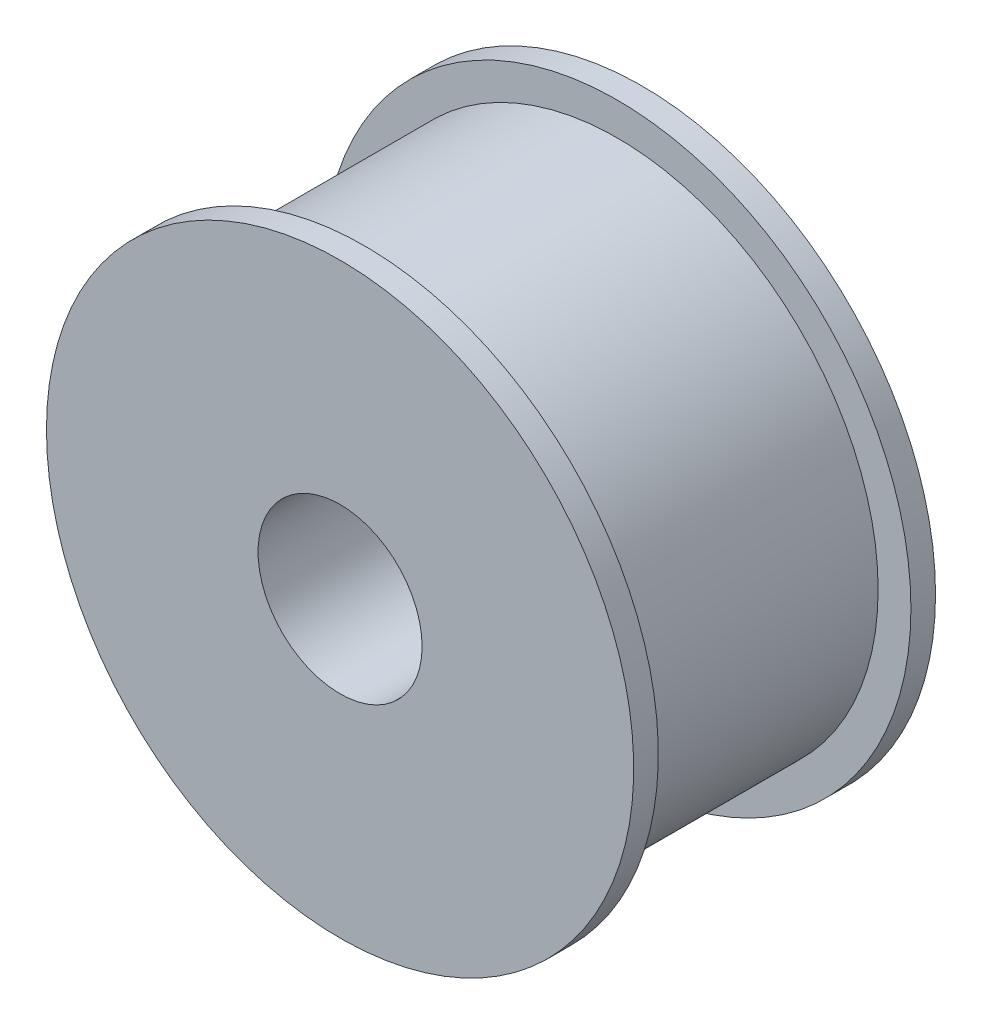
ISO-10303-21;
HEADER;
FILE_DESCRIPTION(('STEP AP214'),'2;1');
FILE_NAME('part.step','',(''),(''),'','','');
FILE_SCHEMA(('AUTOMOTIVE_DESIGN { 1 0 10303 214 1 1 1 1 }'));
ENDSEC;
DATA;
#1=APPLICATION_CONTEXT('core data for automotive mechanical design processes');
#2=APPLICATION_PROTOCOL_DEFINITION('international standard','automotive_design',2000,#1);
#3=PRODUCT_CONTEXT('',#1,'mechanical');
#4=PRODUCT('Part','Part','',(#3));
#5=PRODUCT_RELATED_PRODUCT_CATEGORY('part','',(#4));
#6=PRODUCT_DEFINITION_FORMATION('','',#4);
#7=PRODUCT_DEFINITION_CONTEXT('part definition',#1,'design');
#8=PRODUCT_DEFINITION('design','',#6,#7);
#9=PRODUCT_DEFINITION_SHAPE('','',#8);
#10=(LENGTH_UNIT() NAMED_UNIT(*) SI_UNIT(.MILLI.,.METRE.));
#11=(NAMED_UNIT(*) PLANE_ANGLE_UNIT() SI_UNIT($,.RADIAN.));
#12=(NAMED_UNIT(*) SI_UNIT($,.STERADIAN.) SOLID_ANGLE_UNIT());
#13=UNCERTAINTY_MEASURE_WITH_UNIT(LENGTH_MEASURE(1.E-05),#10,'distance_accuracy_value','');
#14=(GEOMETRIC_REPRESENTATION_CONTEXT(3) GLOBAL_UNCERTAINTY_ASSIGNED_CONTEXT((#13)) GLOBAL_UNIT_ASSIGNED_CONTEXT((#10,
#11,#12)) REPRESENTATION_CONTEXT('',''));
#15=CARTESIAN_POINT('',(0.,0.,0.));
#16=DIRECTION('',(0.,0.,1.));
#17=DIRECTION('',(1.,0.,0.));
#18=AXIS2_PLACEMENT_3D('',#15,#16,#17);
#19=CARTESIAN_POINT('',(0.,0.,0.));
#20=DIRECTION('',(0.,0.,1.));
#21=DIRECTION('',(1.,0.,0.));
#22=AXIS2_PLACEMENT_3D('',#19,#20,#21);
#23=CYLINDRICAL_SURFACE('',#22,2.5);
#24=CARTESIAN_POINT('',(0.,0.,0.));
#25=DIRECTION('',(0.,0.,1.));
#26=DIRECTION('',(1.,0.,0.));
#27=AXIS2_PLACEMENT_3D('',#24,#25,#26);
#28=CIRCLE('',#27,2.5);
#29=CARTESIAN_POINT('',(2.5,0.,0.));
#30=VERTEX_POINT('',#29);
#31=EDGE_CURVE('E40',#30,#30,#28,.F.);
#32=ORIENTED_EDGE('',*,*,#31,.T.);
#33=EDGE_LOOP('',(#32));
#34=FACE_BOUND('',#33,.T.);
#35=CARTESIAN_POINT('',(0.,0.,9.2));
#36=DIRECTION('',(0.,0.,1.));
#37=DIRECTION('',(1.,0.,0.));
#38=AXIS2_PLACEMENT_3D('',#35,#36,#37);
#39=CIRCLE('',#38,2.5);
#40=CARTESIAN_POINT('',(2.5,0.,9.2));
#41=VERTEX_POINT('',#40);
#42=EDGE_CURVE('E18',#41,#41,#39,.F.);
#43=ORIENTED_EDGE('',*,*,#42,.F.);
#44=EDGE_LOOP('',(#43));
#45=FACE_BOUND('',#44,.T.);
#46=ADVANCED_FACE('F15',(#34,#45),#23,.F.);
#47=CARTESIAN_POINT('',(0.,0.,9.2));
#48=DIRECTION('',(0.,0.,1.));
#49=DIRECTION('',(1.,0.,0.));
#50=AXIS2_PLACEMENT_3D('',#47,#48,#49);
#51=PLANE('',#50);
#52=ORIENTED_EDGE('',*,*,#42,.T.);
#53=EDGE_LOOP('',(#52));
#54=FACE_BOUND('',#53,.T.);
#55=CARTESIAN_POINT('',(0.,0.,9.2));
#56=DIRECTION('',(0.,0.,-1.));
#57=DIRECTION('',(-1.,0.,0.));
#58=AXIS2_PLACEMENT_3D('',#55,#56,#57);
#59=CIRCLE('',#58,8.95);
#60=CARTESIAN_POINT('',(-8.95,0.,9.2));
#61=VERTEX_POINT('',#60);
#62=EDGE_CURVE('E38',#61,#61,#59,.T.);
#63=ORIENTED_EDGE('',*,*,#62,.F.);
#64=EDGE_LOOP('',(#63));
#65=FACE_BOUND('',#64,.T.);
#66=ADVANCED_FACE('F47',(#54,#65),#51,.T.);
#67=CARTESIAN_POINT('',(0.,0.,0.));
#68=DIRECTION('',(0.,0.,1.));
#69=DIRECTION('',(1.,0.,0.));
#70=AXIS2_PLACEMENT_3D('',#67,#68,#69);
#71=PLANE('',#70);
#72=ORIENTED_EDGE('',*,*,#31,.F.);
#73=EDGE_LOOP('',(#72));
#74=FACE_BOUND('',#73,.T.);
#75=CARTESIAN_POINT('',(0.,0.,0.));
#76=DIRECTION('',(0.,0.,1.));
#77=DIRECTION('',(1.,0.,0.));
#78=AXIS2_PLACEMENT_3D('',#75,#76,#77);
#79=CIRCLE('',#78,8.95);
#80=CARTESIAN_POINT('',(8.95,0.,0.));
#81=VERTEX_POINT('',#80);
#82=EDGE_CURVE('E35',#81,#81,#79,.T.);
#83=ORIENTED_EDGE('',*,*,#82,.F.);
#84=EDGE_LOOP('',(#83));
#85=FACE_BOUND('',#84,.T.);
#86=ADVANCED_FACE('F55',(#74,#85),#71,.F.);
#87=CARTESIAN_POINT('',(0.,0.,9.2));
#88=DIRECTION('',(0.,0.,-1.));
#89=DIRECTION('',(-1.,0.,0.));
#90=AXIS2_PLACEMENT_3D('',#87,#88,#89);
#91=CYLINDRICAL_SURFACE('',#90,8.95);
#92=ORIENTED_EDGE('',*,*,#62,.T.);
#93=EDGE_LOOP('',(#92));
#94=FACE_BOUND('',#93,.T.);
#95=CARTESIAN_POINT('',(0.,0.,8.45));
#96=DIRECTION('',(0.,0.,-1.));
#97=DIRECTION('',(-1.,0.,0.));
#98=AXIS2_PLACEMENT_3D('',#95,#96,#97);
#99=CIRCLE('',#98,8.95);
#100=CARTESIAN_POINT('',(-8.95,0.,8.45));
#101=VERTEX_POINT('',#100);
#102=EDGE_CURVE('E32',#101,#101,#99,.F.);
#103=ORIENTED_EDGE('',*,*,#102,.T.);
#104=EDGE_LOOP('',(#103));
#105=FACE_BOUND('',#104,.T.);
#106=ADVANCED_FACE('F74',(#94,#105),#91,.T.);
#107=CARTESIAN_POINT('',(0.,0.,0.));
#108=DIRECTION('',(0.,0.,1.));
#109=DIRECTION('',(1.,0.,0.));
#110=AXIS2_PLACEMENT_3D('',#107,#108,#109);
#111=CYLINDRICAL_SURFACE('',#110,8.95);
#112=ORIENTED_EDGE('',*,*,#82,.T.);
#113=EDGE_LOOP('',(#112));
#114=FACE_BOUND('',#113,.T.);
#115=CARTESIAN_POINT('',(0.,0.,0.75));
#116=DIRECTION('',(0.,0.,1.));
#117=DIRECTION('',(1.,0.,0.));
#118=AXIS2_PLACEMENT_3D('',#115,#116,#117);
#119=CIRCLE('',#118,8.95);
#120=CARTESIAN_POINT('',(8.95,0.,0.75));
#121=VERTEX_POINT('',#120);
#122=EDGE_CURVE('E27',#121,#121,#119,.T.);
#123=ORIENTED_EDGE('',*,*,#122,.F.);
#124=EDGE_LOOP('',(#123));
#125=FACE_BOUND('',#124,.T.);
#126=ADVANCED_FACE('F70',(#114,#125),#111,.T.);
#127=CARTESIAN_POINT('',(0.,0.,8.45));
#128=DIRECTION('',(0.,0.,1.));
#129=DIRECTION('',(1.,0.,0.));
#130=AXIS2_PLACEMENT_3D('',#127,#128,#129);
#131=PLANE('',#130);
#132=CARTESIAN_POINT('',(0.,0.,8.45));
#133=DIRECTION('',(0.,0.,1.));
#134=DIRECTION('',(1.,0.,0.));
#135=AXIS2_PLACEMENT_3D('',#132,#133,#134);
#136=CIRCLE('',#135,7.95);
#137=CARTESIAN_POINT('',(7.95,0.,8.45));
#138=VERTEX_POINT('',#137);
#139=EDGE_CURVE('E22',#138,#138,#136,.F.);
#140=ORIENTED_EDGE('',*,*,#139,.F.);
#141=EDGE_LOOP('',(#140));
#142=FACE_BOUND('',#141,.T.);
#143=ORIENTED_EDGE('',*,*,#102,.F.);
#144=EDGE_LOOP('',(#143));
#145=FACE_BOUND('',#144,.T.);
#146=ADVANCED_FACE('F63',(#142,#145),#131,.F.);
#147=CARTESIAN_POINT('',(0.,0.,0.75));
#148=DIRECTION('',(0.,0.,1.));
#149=DIRECTION('',(1.,0.,0.));
#150=AXIS2_PLACEMENT_3D('',#147,#148,#149);
#151=PLANE('',#150);
#152=CARTESIAN_POINT('',(0.,0.,0.75));
#153=DIRECTION('',(0.,0.,1.));
#154=DIRECTION('',(1.,0.,0.));
#155=AXIS2_PLACEMENT_3D('',#152,#153,#154);
#156=CIRCLE('',#155,7.95);
#157=CARTESIAN_POINT('',(7.95,0.,0.75));
#158=VERTEX_POINT('',#157);
#159=EDGE_CURVE('E10',#158,#158,#156,.T.);
#160=ORIENTED_EDGE('',*,*,#159,.F.);
#161=EDGE_LOOP('',(#160));
#162=FACE_BOUND('',#161,.T.);
#163=ORIENTED_EDGE('',*,*,#122,.T.);
#164=EDGE_LOOP('',(#163));
#165=FACE_BOUND('',#164,.T.);
#166=ADVANCED_FACE('F58',(#162,#165),#151,.T.);
#167=CARTESIAN_POINT('',(0.,0.,0.));
#168=DIRECTION('',(0.,0.,1.));
#169=DIRECTION('',(1.,0.,0.));
#170=AXIS2_PLACEMENT_3D('',#167,#168,#169);
#171=CYLINDRICAL_SURFACE('',#170,7.95);
#172=ORIENTED_EDGE('',*,*,#159,.T.);
#173=EDGE_LOOP('',(#172));
#174=FACE_BOUND('',#173,.T.);
#175=ORIENTED_EDGE('',*,*,#139,.T.);
#176=EDGE_LOOP('',(#175));
#177=FACE_BOUND('',#176,.T.);
#178=ADVANCED_FACE('F56',(#174,#177),#171,.T.);
#179=CLOSED_SHELL('',(#46,#66,#86,#106,#126,#146,#166,#178));
#180=MANIFOLD_SOLID_BREP('B1',#179);
#181=ADVANCED_BREP_SHAPE_REPRESENTATION('',(#18,#180),#14);
#182=SHAPE_DEFINITION_REPRESENTATION(#9,#181);
ENDSEC;
END-ISO-10303-21;
